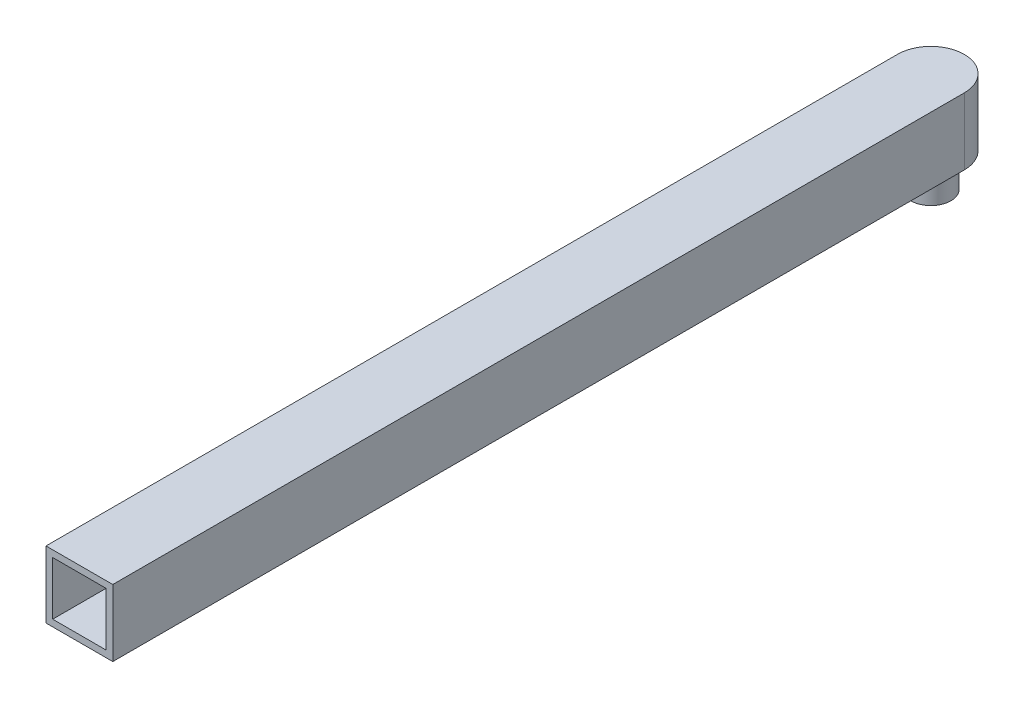
ISO-10303-21;
HEADER;
FILE_DESCRIPTION(('STEP AP214'),'2;1');
FILE_NAME('part.step','',(''),(''),'','','');
FILE_SCHEMA(('AUTOMOTIVE_DESIGN { 1 0 10303 214 1 1 1 1 }'));
ENDSEC;
DATA;
#1=APPLICATION_CONTEXT('core data for automotive mechanical design processes');
#2=APPLICATION_PROTOCOL_DEFINITION('international standard','automotive_design',2000,#1);
#3=PRODUCT_CONTEXT('',#1,'mechanical');
#4=PRODUCT('Part','Part','',(#3));
#5=PRODUCT_RELATED_PRODUCT_CATEGORY('part','',(#4));
#6=PRODUCT_DEFINITION_FORMATION('','',#4);
#7=PRODUCT_DEFINITION_CONTEXT('part definition',#1,'design');
#8=PRODUCT_DEFINITION('design','',#6,#7);
#9=PRODUCT_DEFINITION_SHAPE('','',#8);
#10=(LENGTH_UNIT() NAMED_UNIT(*) SI_UNIT(.MILLI.,.METRE.));
#11=(NAMED_UNIT(*) PLANE_ANGLE_UNIT() SI_UNIT($,.RADIAN.));
#12=(NAMED_UNIT(*) SI_UNIT($,.STERADIAN.) SOLID_ANGLE_UNIT());
#13=UNCERTAINTY_MEASURE_WITH_UNIT(LENGTH_MEASURE(1.E-05),#10,'distance_accuracy_value','');
#14=(GEOMETRIC_REPRESENTATION_CONTEXT(3) GLOBAL_UNCERTAINTY_ASSIGNED_CONTEXT((#13)) GLOBAL_UNIT_ASSIGNED_CONTEXT((#10,
#11,#12)) REPRESENTATION_CONTEXT('',''));
#15=CARTESIAN_POINT('',(0.,0.,0.));
#16=DIRECTION('',(0.,0.,1.));
#17=DIRECTION('',(1.,0.,0.));
#18=AXIS2_PLACEMENT_3D('',#15,#16,#17);
#19=CARTESIAN_POINT('',(-12.7,25.4,161.925));
#20=DIRECTION('',(0.,0.,-1.));
#21=DIRECTION('',(-1.,0.,0.));
#22=AXIS2_PLACEMENT_3D('',#19,#20,#21);
#23=PLANE('',#22);
#24=DIRECTION('',(1.,0.,0.));
#25=VECTOR('',#24,1.);
#26=CARTESIAN_POINT('',(-10.16,2.54,161.925));
#27=LINE('',#26,#25);
#28=CARTESIAN_POINT('',(-10.16,2.54,161.925));
#29=VERTEX_POINT('',#28);
#30=CARTESIAN_POINT('',(10.16,2.54,161.925));
#31=VERTEX_POINT('',#30);
#32=EDGE_CURVE('E155',#29,#31,#27,.T.);
#33=ORIENTED_EDGE('',*,*,#32,.F.);
#34=DIRECTION('',(0.,-1.,0.));
#35=VECTOR('',#34,1.);
#36=CARTESIAN_POINT('',(-10.16,22.86,161.925));
#37=LINE('',#36,#35);
#38=CARTESIAN_POINT('',(-10.16,22.86,161.925));
#39=VERTEX_POINT('',#38);
#40=EDGE_CURVE('E58',#39,#29,#37,.T.);
#41=ORIENTED_EDGE('',*,*,#40,.F.);
#42=DIRECTION('',(-1.,0.,0.));
#43=VECTOR('',#42,1.);
#44=CARTESIAN_POINT('',(10.16,22.86,161.925));
#45=LINE('',#44,#43);
#46=CARTESIAN_POINT('',(10.16,22.86,161.925));
#47=VERTEX_POINT('',#46);
#48=EDGE_CURVE('E139',#47,#39,#45,.T.);
#49=ORIENTED_EDGE('',*,*,#48,.F.);
#50=DIRECTION('',(0.,1.,0.));
#51=VECTOR('',#50,1.);
#52=CARTESIAN_POINT('',(10.16,2.54,161.925));
#53=LINE('',#52,#51);
#54=EDGE_CURVE('E143',#31,#47,#53,.T.);
#55=ORIENTED_EDGE('',*,*,#54,.F.);
#56=EDGE_LOOP('',(#33,#41,#49,#55));
#57=FACE_BOUND('',#56,.T.);
#58=DIRECTION('',(1.,0.,0.));
#59=VECTOR('',#58,1.);
#60=CARTESIAN_POINT('',(-12.7,0.,161.925));
#61=LINE('',#60,#59);
#62=CARTESIAN_POINT('',(-12.7,0.,161.925));
#63=VERTEX_POINT('',#62);
#64=CARTESIAN_POINT('',(12.7,0.,161.925));
#65=VERTEX_POINT('',#64);
#66=EDGE_CURVE('E165',#63,#65,#61,.T.);
#67=ORIENTED_EDGE('',*,*,#66,.T.);
#68=DIRECTION('',(0.,-1.,0.));
#69=VECTOR('',#68,1.);
#70=CARTESIAN_POINT('',(12.7,25.4,161.925));
#71=LINE('',#70,#69);
#72=CARTESIAN_POINT('',(12.7,25.4,161.925));
#73=VERTEX_POINT('',#72);
#74=EDGE_CURVE('E11',#73,#65,#71,.T.);
#75=ORIENTED_EDGE('',*,*,#74,.F.);
#76=DIRECTION('',(1.,0.,0.));
#77=VECTOR('',#76,1.);
#78=CARTESIAN_POINT('',(-12.7,25.4,161.925));
#79=LINE('',#78,#77);
#80=CARTESIAN_POINT('',(-12.7,25.4,161.925));
#81=VERTEX_POINT('',#80);
#82=EDGE_CURVE('E171',#81,#73,#79,.T.);
#83=ORIENTED_EDGE('',*,*,#82,.F.);
#84=DIRECTION('',(0.,-1.,0.));
#85=VECTOR('',#84,1.);
#86=CARTESIAN_POINT('',(-12.7,25.4,161.925));
#87=LINE('',#86,#85);
#88=EDGE_CURVE('E67',#81,#63,#87,.T.);
#89=ORIENTED_EDGE('',*,*,#88,.T.);
#90=EDGE_LOOP('',(#67,#75,#83,#89));
#91=FACE_BOUND('',#90,.T.);
#92=ADVANCED_FACE('F43',(#57,#91),#23,.F.);
#93=CARTESIAN_POINT('',(12.7,25.4,161.925));
#94=DIRECTION('',(-1.,0.,0.));
#95=DIRECTION('',(0.,0.,1.));
#96=AXIS2_PLACEMENT_3D('',#93,#94,#95);
#97=PLANE('',#96);
#98=DIRECTION('',(0.,0.,-1.));
#99=VECTOR('',#98,1.);
#100=CARTESIAN_POINT('',(12.7,0.,161.925));
#101=LINE('',#100,#99);
#102=CARTESIAN_POINT('',(12.7,0.,-161.925));
#103=VERTEX_POINT('',#102);
#104=EDGE_CURVE('E186',#65,#103,#101,.T.);
#105=ORIENTED_EDGE('',*,*,#104,.T.);
#106=DIRECTION('',(0.,-1.,0.));
#107=VECTOR('',#106,1.);
#108=CARTESIAN_POINT('',(12.7,25.4,-161.925));
#109=LINE('',#108,#107);
#110=CARTESIAN_POINT('',(12.7,25.4,-161.925));
#111=VERTEX_POINT('',#110);
#112=EDGE_CURVE('E51',#111,#103,#109,.T.);
#113=ORIENTED_EDGE('',*,*,#112,.F.);
#114=DIRECTION('',(0.,0.,-1.));
#115=VECTOR('',#114,1.);
#116=CARTESIAN_POINT('',(12.7,25.4,161.925));
#117=LINE('',#116,#115);
#118=EDGE_CURVE('E93',#73,#111,#117,.T.);
#119=ORIENTED_EDGE('',*,*,#118,.F.);
#120=ORIENTED_EDGE('',*,*,#74,.T.);
#121=EDGE_LOOP('',(#105,#113,#119,#120));
#122=FACE_BOUND('',#121,.T.);
#123=ADVANCED_FACE('F206',(#122),#97,.F.);
#124=CARTESIAN_POINT('',(0.,25.4,-161.925));
#125=DIRECTION('',(0.,-1.,0.));
#126=DIRECTION('',(0.,0.,-1.));
#127=AXIS2_PLACEMENT_3D('',#124,#125,#126);
#128=CYLINDRICAL_SURFACE('',#127,12.7);
#129=CARTESIAN_POINT('',(0.,0.,-161.925));
#130=DIRECTION('',(0.,-1.,0.));
#131=DIRECTION('',(0.,0.,-1.));
#132=AXIS2_PLACEMENT_3D('',#129,#130,#131);
#133=CIRCLE('',#132,12.7);
#134=CARTESIAN_POINT('',(-12.7,0.,-161.925));
#135=VERTEX_POINT('',#134);
#136=EDGE_CURVE('E190',#135,#103,#133,.T.);
#137=ORIENTED_EDGE('',*,*,#136,.F.);
#138=DIRECTION('',(0.,-1.,0.));
#139=VECTOR('',#138,1.);
#140=CARTESIAN_POINT('',(-12.7,25.4,-161.925));
#141=LINE('',#140,#139);
#142=CARTESIAN_POINT('',(-12.7,25.4,-161.925));
#143=VERTEX_POINT('',#142);
#144=EDGE_CURVE('E199',#143,#135,#141,.T.);
#145=ORIENTED_EDGE('',*,*,#144,.F.);
#146=CARTESIAN_POINT('',(0.,25.4,-161.925));
#147=DIRECTION('',(0.,-1.,0.));
#148=DIRECTION('',(0.,0.,-1.));
#149=AXIS2_PLACEMENT_3D('',#146,#147,#148);
#150=CIRCLE('',#149,12.7);
#151=EDGE_CURVE('E177',#143,#111,#150,.T.);
#152=ORIENTED_EDGE('',*,*,#151,.T.);
#153=ORIENTED_EDGE('',*,*,#112,.T.);
#154=EDGE_LOOP('',(#137,#145,#152,#153));
#155=FACE_BOUND('',#154,.T.);
#156=ADVANCED_FACE('F204',(#155),#128,.T.);
#157=CARTESIAN_POINT('',(-12.7,25.4,161.925));
#158=DIRECTION('',(-1.,0.,0.));
#159=DIRECTION('',(0.,0.,1.));
#160=AXIS2_PLACEMENT_3D('',#157,#158,#159);
#161=PLANE('',#160);
#162=DIRECTION('',(0.,0.,-1.));
#163=VECTOR('',#162,1.);
#164=CARTESIAN_POINT('',(-12.7,0.,161.925));
#165=LINE('',#164,#163);
#166=EDGE_CURVE('E174',#63,#135,#165,.T.);
#167=ORIENTED_EDGE('',*,*,#166,.F.);
#168=ORIENTED_EDGE('',*,*,#88,.F.);
#169=DIRECTION('',(0.,0.,-1.));
#170=VECTOR('',#169,1.);
#171=CARTESIAN_POINT('',(-12.7,25.4,161.925));
#172=LINE('',#171,#170);
#173=EDGE_CURVE('E181',#81,#143,#172,.T.);
#174=ORIENTED_EDGE('',*,*,#173,.T.);
#175=ORIENTED_EDGE('',*,*,#144,.T.);
#176=EDGE_LOOP('',(#167,#168,#174,#175));
#177=FACE_BOUND('',#176,.T.);
#178=ADVANCED_FACE('F210',(#177),#161,.T.);
#179=CARTESIAN_POINT('',(0.,25.4,-161.925));
#180=DIRECTION('',(0.,-1.,0.));
#181=DIRECTION('',(0.,0.,-1.));
#182=AXIS2_PLACEMENT_3D('',#179,#180,#181);
#183=PLANE('',#182);
#184=ORIENTED_EDGE('',*,*,#82,.T.);
#185=ORIENTED_EDGE('',*,*,#118,.T.);
#186=ORIENTED_EDGE('',*,*,#151,.F.);
#187=ORIENTED_EDGE('',*,*,#173,.F.);
#188=EDGE_LOOP('',(#184,#185,#186,#187));
#189=FACE_BOUND('',#188,.T.);
#190=ADVANCED_FACE('F213',(#189),#183,.F.);
#191=CARTESIAN_POINT('',(0.,0.,-161.925));
#192=DIRECTION('',(0.,-1.,0.));
#193=DIRECTION('',(0.,0.,-1.));
#194=AXIS2_PLACEMENT_3D('',#191,#192,#193);
#195=PLANE('',#194);
#196=CARTESIAN_POINT('',(0.,0.,-161.925));
#197=DIRECTION('',(0.,-1.,0.));
#198=DIRECTION('',(0.,0.,-1.));
#199=AXIS2_PLACEMENT_3D('',#196,#197,#198);
#200=CIRCLE('',#199,7.62);
#201=CARTESIAN_POINT('',(0.,0.,-169.545));
#202=VERTEX_POINT('',#201);
#203=EDGE_CURVE('E146',#202,#202,#200,.T.);
#204=ORIENTED_EDGE('',*,*,#203,.F.);
#205=EDGE_LOOP('',(#204));
#206=FACE_BOUND('',#205,.T.);
#207=ORIENTED_EDGE('',*,*,#66,.F.);
#208=ORIENTED_EDGE('',*,*,#166,.T.);
#209=ORIENTED_EDGE('',*,*,#136,.T.);
#210=ORIENTED_EDGE('',*,*,#104,.F.);
#211=EDGE_LOOP('',(#207,#208,#209,#210));
#212=FACE_BOUND('',#211,.T.);
#213=ADVANCED_FACE('F209',(#206,#212),#195,.T.);
#214=CARTESIAN_POINT('',(-10.16,22.86,-160.654999999999));
#215=DIRECTION('',(-1.,0.,0.));
#216=DIRECTION('',(0.,0.,1.));
#217=AXIS2_PLACEMENT_3D('',#214,#215,#216);
#218=PLANE('',#217);
#219=ORIENTED_EDGE('',*,*,#40,.T.);
#220=DIRECTION('',(0.,0.,1.));
#221=VECTOR('',#220,1.);
#222=CARTESIAN_POINT('',(-10.16,2.54,-160.654999999999));
#223=LINE('',#222,#221);
#224=CARTESIAN_POINT('',(-10.16,2.54,-160.654999999999));
#225=VERTEX_POINT('',#224);
#226=EDGE_CURVE('E114',#225,#29,#223,.T.);
#227=ORIENTED_EDGE('',*,*,#226,.F.);
#228=DIRECTION('',(0.,-1.,0.));
#229=VECTOR('',#228,1.);
#230=CARTESIAN_POINT('',(-10.16,22.86,-160.654999999999));
#231=LINE('',#230,#229);
#232=CARTESIAN_POINT('',(-10.16,22.86,-160.654999999999));
#233=VERTEX_POINT('',#232);
#234=EDGE_CURVE('E118',#233,#225,#231,.T.);
#235=ORIENTED_EDGE('',*,*,#234,.F.);
#236=DIRECTION('',(0.,0.,1.));
#237=VECTOR('',#236,1.);
#238=CARTESIAN_POINT('',(-10.16,22.86,-160.654999999999));
#239=LINE('',#238,#237);
#240=EDGE_CURVE('E162',#233,#39,#239,.T.);
#241=ORIENTED_EDGE('',*,*,#240,.T.);
#242=EDGE_LOOP('',(#219,#227,#235,#241));
#243=FACE_BOUND('',#242,.T.);
#244=ADVANCED_FACE('F116',(#243),#218,.F.);
#245=CARTESIAN_POINT('',(10.16,22.86,-160.654999999999));
#246=DIRECTION('',(0.,1.,0.));
#247=DIRECTION('',(0.,0.,1.));
#248=AXIS2_PLACEMENT_3D('',#245,#246,#247);
#249=PLANE('',#248);
#250=ORIENTED_EDGE('',*,*,#48,.T.);
#251=ORIENTED_EDGE('',*,*,#240,.F.);
#252=DIRECTION('',(-1.,0.,0.));
#253=VECTOR('',#252,1.);
#254=CARTESIAN_POINT('',(10.16,22.86,-160.654999999999));
#255=LINE('',#254,#253);
#256=CARTESIAN_POINT('',(10.16,22.86,-160.654999999999));
#257=VERTEX_POINT('',#256);
#258=EDGE_CURVE('E125',#257,#233,#255,.T.);
#259=ORIENTED_EDGE('',*,*,#258,.F.);
#260=DIRECTION('',(0.,0.,1.));
#261=VECTOR('',#260,1.);
#262=CARTESIAN_POINT('',(10.16,22.86,-160.654999999999));
#263=LINE('',#262,#261);
#264=EDGE_CURVE('E166',#257,#47,#263,.T.);
#265=ORIENTED_EDGE('',*,*,#264,.T.);
#266=EDGE_LOOP('',(#250,#251,#259,#265));
#267=FACE_BOUND('',#266,.T.);
#268=ADVANCED_FACE('F224',(#267),#249,.F.);
#269=CARTESIAN_POINT('',(10.16,2.54,-160.654999999999));
#270=DIRECTION('',(1.,0.,0.));
#271=DIRECTION('',(0.,0.,-1.));
#272=AXIS2_PLACEMENT_3D('',#269,#270,#271);
#273=PLANE('',#272);
#274=ORIENTED_EDGE('',*,*,#54,.T.);
#275=ORIENTED_EDGE('',*,*,#264,.F.);
#276=DIRECTION('',(0.,1.,0.));
#277=VECTOR('',#276,1.);
#278=CARTESIAN_POINT('',(10.16,2.54,-160.654999999999));
#279=LINE('',#278,#277);
#280=CARTESIAN_POINT('',(10.16,2.54,-160.654999999999));
#281=VERTEX_POINT('',#280);
#282=EDGE_CURVE('E134',#281,#257,#279,.T.);
#283=ORIENTED_EDGE('',*,*,#282,.F.);
#284=DIRECTION('',(0.,0.,1.));
#285=VECTOR('',#284,1.);
#286=CARTESIAN_POINT('',(10.16,2.54,-160.654999999999));
#287=LINE('',#286,#285);
#288=EDGE_CURVE('E124',#281,#31,#287,.T.);
#289=ORIENTED_EDGE('',*,*,#288,.T.);
#290=EDGE_LOOP('',(#274,#275,#283,#289));
#291=FACE_BOUND('',#290,.T.);
#292=ADVANCED_FACE('F222',(#291),#273,.F.);
#293=CARTESIAN_POINT('',(-10.16,2.54,-160.654999999999));
#294=DIRECTION('',(0.,-1.,0.));
#295=DIRECTION('',(0.,0.,-1.));
#296=AXIS2_PLACEMENT_3D('',#293,#294,#295);
#297=PLANE('',#296);
#298=ORIENTED_EDGE('',*,*,#32,.T.);
#299=ORIENTED_EDGE('',*,*,#288,.F.);
#300=DIRECTION('',(1.,0.,0.));
#301=VECTOR('',#300,1.);
#302=CARTESIAN_POINT('',(-10.16,2.54,-160.654999999999));
#303=LINE('',#302,#301);
#304=EDGE_CURVE('E128',#225,#281,#303,.T.);
#305=ORIENTED_EDGE('',*,*,#304,.F.);
#306=ORIENTED_EDGE('',*,*,#226,.T.);
#307=EDGE_LOOP('',(#298,#299,#305,#306));
#308=FACE_BOUND('',#307,.T.);
#309=ADVANCED_FACE('F129',(#308),#297,.F.);
#310=CARTESIAN_POINT('',(0.,0.,-160.654999999999));
#311=DIRECTION('',(0.,0.,1.));
#312=DIRECTION('',(1.,0.,0.));
#313=AXIS2_PLACEMENT_3D('',#310,#311,#312);
#314=PLANE('',#313);
#315=ORIENTED_EDGE('',*,*,#234,.T.);
#316=ORIENTED_EDGE('',*,*,#304,.T.);
#317=ORIENTED_EDGE('',*,*,#282,.T.);
#318=ORIENTED_EDGE('',*,*,#258,.T.);
#319=EDGE_LOOP('',(#315,#316,#317,#318));
#320=FACE_BOUND('',#319,.T.);
#321=ADVANCED_FACE('F136',(#320),#314,.T.);
#322=CARTESIAN_POINT('',(0.,-12.7,-161.925));
#323=DIRECTION('',(0.,1.,0.));
#324=DIRECTION('',(0.,0.,1.));
#325=AXIS2_PLACEMENT_3D('',#322,#323,#324);
#326=CYLINDRICAL_SURFACE('',#325,7.62);
#327=CARTESIAN_POINT('',(0.,-12.7,-161.925));
#328=DIRECTION('',(0.,-1.,0.));
#329=DIRECTION('',(0.,0.,-1.));
#330=AXIS2_PLACEMENT_3D('',#327,#328,#329);
#331=CIRCLE('',#330,7.62);
#332=CARTESIAN_POINT('',(0.,-12.7,-169.545));
#333=VERTEX_POINT('',#332);
#334=EDGE_CURVE('E156',#333,#333,#331,.T.);
#335=ORIENTED_EDGE('',*,*,#334,.F.);
#336=EDGE_LOOP('',(#335));
#337=FACE_BOUND('',#336,.T.);
#338=ORIENTED_EDGE('',*,*,#203,.T.);
#339=EDGE_LOOP('',(#338));
#340=FACE_BOUND('',#339,.T.);
#341=ADVANCED_FACE('F297',(#337,#340),#326,.T.);
#342=CARTESIAN_POINT('',(0.,-12.7,-161.925));
#343=DIRECTION('',(0.,-1.,0.));
#344=DIRECTION('',(0.,0.,-1.));
#345=AXIS2_PLACEMENT_3D('',#342,#343,#344);
#346=PLANE('',#345);
#347=ORIENTED_EDGE('',*,*,#334,.T.);
#348=EDGE_LOOP('',(#347));
#349=FACE_BOUND('',#348,.T.);
#350=ADVANCED_FACE('F306',(#349),#346,.T.);
#351=CLOSED_SHELL('',(#92,#123,#156,#178,#190,#213,#244,#268,#292,#309,#321,#341,#350));
#352=MANIFOLD_SOLID_BREP('B2',#351);
#353=ADVANCED_BREP_SHAPE_REPRESENTATION('',(#18,#352),#14);
#354=SHAPE_DEFINITION_REPRESENTATION(#9,#353);
ENDSEC;
END-ISO-10303-21;
